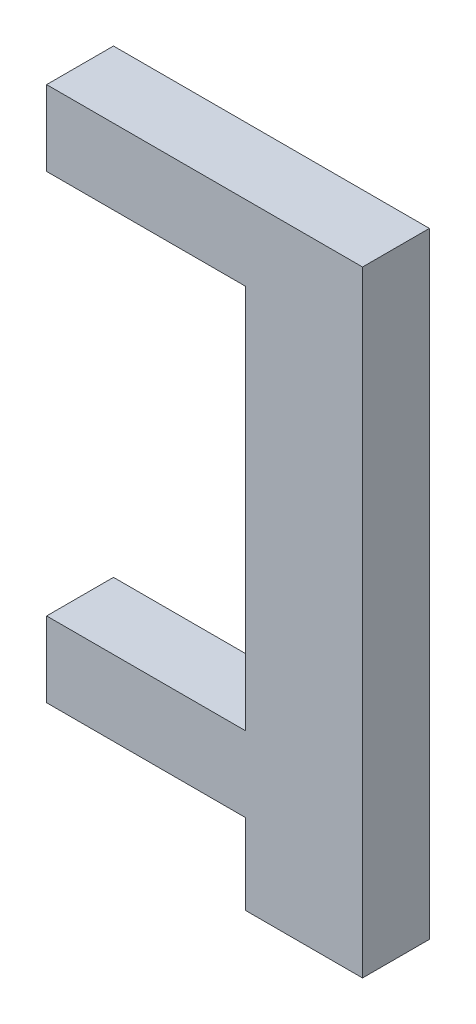
ISO-10303-21;
HEADER;
FILE_DESCRIPTION(('STEP AP214'),'2;1');
FILE_NAME('part.step','',(''),(''),'','','');
FILE_SCHEMA(('AUTOMOTIVE_DESIGN { 1 0 10303 214 1 1 1 1 }'));
ENDSEC;
DATA;
#1=APPLICATION_CONTEXT('core data for automotive mechanical design processes');
#2=APPLICATION_PROTOCOL_DEFINITION('international standard','automotive_design',2000,#1);
#3=PRODUCT_CONTEXT('',#1,'mechanical');
#4=PRODUCT('Part','Part','',(#3));
#5=PRODUCT_RELATED_PRODUCT_CATEGORY('part','',(#4));
#6=PRODUCT_DEFINITION_FORMATION('','',#4);
#7=PRODUCT_DEFINITION_CONTEXT('part definition',#1,'design');
#8=PRODUCT_DEFINITION('design','',#6,#7);
#9=PRODUCT_DEFINITION_SHAPE('','',#8);
#10=(LENGTH_UNIT() NAMED_UNIT(*) SI_UNIT(.MILLI.,.METRE.));
#11=(NAMED_UNIT(*) PLANE_ANGLE_UNIT() SI_UNIT($,.RADIAN.));
#12=(NAMED_UNIT(*) SI_UNIT($,.STERADIAN.) SOLID_ANGLE_UNIT());
#13=UNCERTAINTY_MEASURE_WITH_UNIT(LENGTH_MEASURE(1.E-05),#10,'distance_accuracy_value','');
#14=(GEOMETRIC_REPRESENTATION_CONTEXT(3) GLOBAL_UNCERTAINTY_ASSIGNED_CONTEXT((#13)) GLOBAL_UNIT_ASSIGNED_CONTEXT((#10,
#11,#12)) REPRESENTATION_CONTEXT('',''));
#15=CARTESIAN_POINT('',(0.,0.,0.));
#16=DIRECTION('',(0.,0.,1.));
#17=DIRECTION('',(1.,0.,0.));
#18=AXIS2_PLACEMENT_3D('',#15,#16,#17);
#19=CARTESIAN_POINT('',(-7.,0.,4.));
#20=DIRECTION('',(0.,1.,0.));
#21=DIRECTION('',(0.,0.,1.));
#22=AXIS2_PLACEMENT_3D('',#19,#20,#21);
#23=PLANE('',#22);
#24=DIRECTION('',(1.,0.,0.));
#25=VECTOR('',#24,1.);
#26=CARTESIAN_POINT('',(-7.,0.,0.));
#27=LINE('',#26,#25);
#28=CARTESIAN_POINT('',(-7.,0.,0.));
#29=VERTEX_POINT('',#28);
#30=CARTESIAN_POINT('',(0.,0.,0.));
#31=VERTEX_POINT('',#30);
#32=EDGE_CURVE('E140',#29,#31,#27,.T.);
#33=ORIENTED_EDGE('',*,*,#32,.T.);
#34=DIRECTION('',(0.,0.,-1.));
#35=VECTOR('',#34,1.);
#36=CARTESIAN_POINT('',(0.,0.,4.));
#37=LINE('',#36,#35);
#38=CARTESIAN_POINT('',(0.,0.,4.));
#39=VERTEX_POINT('',#38);
#40=EDGE_CURVE('E11',#39,#31,#37,.T.);
#41=ORIENTED_EDGE('',*,*,#40,.F.);
#42=DIRECTION('',(1.,0.,0.));
#43=VECTOR('',#42,1.);
#44=CARTESIAN_POINT('',(-7.,0.,4.));
#45=LINE('',#44,#43);
#46=CARTESIAN_POINT('',(-7.,0.,4.));
#47=VERTEX_POINT('',#46);
#48=EDGE_CURVE('E158',#47,#39,#45,.T.);
#49=ORIENTED_EDGE('',*,*,#48,.F.);
#50=DIRECTION('',(0.,0.,-1.));
#51=VECTOR('',#50,1.);
#52=CARTESIAN_POINT('',(-7.,0.,4.));
#53=LINE('',#52,#51);
#54=EDGE_CURVE('E136',#47,#29,#53,.T.);
#55=ORIENTED_EDGE('',*,*,#54,.T.);
#56=EDGE_LOOP('',(#33,#41,#49,#55));
#57=FACE_BOUND('',#56,.T.);
#58=ADVANCED_FACE('F32',(#57),#23,.F.);
#59=CARTESIAN_POINT('',(0.,0.,4.));
#60=DIRECTION('',(-1.,0.,0.));
#61=DIRECTION('',(0.,0.,1.));
#62=AXIS2_PLACEMENT_3D('',#59,#60,#61);
#63=PLANE('',#62);
#64=DIRECTION('',(0.,1.,0.));
#65=VECTOR('',#64,1.);
#66=CARTESIAN_POINT('',(0.,0.,0.));
#67=LINE('',#66,#65);
#68=CARTESIAN_POINT('',(0.,36.84,0.));
#69=VERTEX_POINT('',#68);
#70=EDGE_CURVE('E143',#31,#69,#67,.T.);
#71=ORIENTED_EDGE('',*,*,#70,.T.);
#72=DIRECTION('',(0.,0.,-1.));
#73=VECTOR('',#72,1.);
#74=CARTESIAN_POINT('',(0.,36.84,4.));
#75=LINE('',#74,#73);
#76=CARTESIAN_POINT('',(0.,36.84,4.));
#77=VERTEX_POINT('',#76);
#78=EDGE_CURVE('E40',#77,#69,#75,.T.);
#79=ORIENTED_EDGE('',*,*,#78,.F.);
#80=DIRECTION('',(0.,1.,0.));
#81=VECTOR('',#80,1.);
#82=CARTESIAN_POINT('',(0.,0.,4.));
#83=LINE('',#82,#81);
#84=EDGE_CURVE('E97',#39,#77,#83,.T.);
#85=ORIENTED_EDGE('',*,*,#84,.F.);
#86=ORIENTED_EDGE('',*,*,#40,.T.);
#87=EDGE_LOOP('',(#71,#79,#85,#86));
#88=FACE_BOUND('',#87,.T.);
#89=ADVANCED_FACE('F207',(#88),#63,.F.);
#90=CARTESIAN_POINT('',(0.,36.84,4.));
#91=DIRECTION('',(0.,-1.,0.));
#92=DIRECTION('',(1.,0.,0.));
#93=AXIS2_PLACEMENT_3D('',#90,#91,#92);
#94=PLANE('',#93);
#95=DIRECTION('',(-1.,0.,0.));
#96=VECTOR('',#95,1.);
#97=CARTESIAN_POINT('',(0.,36.84,0.));
#98=LINE('',#97,#96);
#99=CARTESIAN_POINT('',(-18.9,36.84,0.));
#100=VERTEX_POINT('',#99);
#101=EDGE_CURVE('E145',#69,#100,#98,.T.);
#102=ORIENTED_EDGE('',*,*,#101,.T.);
#103=DIRECTION('',(0.,0.,-1.));
#104=VECTOR('',#103,1.);
#105=CARTESIAN_POINT('',(-18.9,36.84,4.));
#106=LINE('',#105,#104);
#107=CARTESIAN_POINT('',(-18.9,36.84,4.));
#108=VERTEX_POINT('',#107);
#109=EDGE_CURVE('E171',#108,#100,#106,.T.);
#110=ORIENTED_EDGE('',*,*,#109,.F.);
#111=DIRECTION('',(-1.,0.,0.));
#112=VECTOR('',#111,1.);
#113=CARTESIAN_POINT('',(0.,36.84,4.));
#114=LINE('',#113,#112);
#115=EDGE_CURVE('E179',#77,#108,#114,.T.);
#116=ORIENTED_EDGE('',*,*,#115,.F.);
#117=ORIENTED_EDGE('',*,*,#78,.T.);
#118=EDGE_LOOP('',(#102,#110,#116,#117));
#119=FACE_BOUND('',#118,.T.);
#120=ADVANCED_FACE('F177',(#119),#94,.F.);
#121=CARTESIAN_POINT('',(-18.9,36.84,4.));
#122=DIRECTION('',(1.,0.,0.));
#123=DIRECTION('',(0.,0.,-1.));
#124=AXIS2_PLACEMENT_3D('',#121,#122,#123);
#125=PLANE('',#124);
#126=DIRECTION('',(0.,-1.,0.));
#127=VECTOR('',#126,1.);
#128=CARTESIAN_POINT('',(-18.9,36.84,0.));
#129=LINE('',#128,#127);
#130=CARTESIAN_POINT('',(-18.9,32.34,0.));
#131=VERTEX_POINT('',#130);
#132=EDGE_CURVE('E147',#100,#131,#129,.T.);
#133=ORIENTED_EDGE('',*,*,#132,.T.);
#134=DIRECTION('',(0.,0.,-1.));
#135=VECTOR('',#134,1.);
#136=CARTESIAN_POINT('',(-18.9,32.34,4.));
#137=LINE('',#136,#135);
#138=CARTESIAN_POINT('',(-18.9,32.34,4.));
#139=VERTEX_POINT('',#138);
#140=EDGE_CURVE('E168',#139,#131,#137,.T.);
#141=ORIENTED_EDGE('',*,*,#140,.F.);
#142=DIRECTION('',(0.,-1.,0.));
#143=VECTOR('',#142,1.);
#144=CARTESIAN_POINT('',(-18.9,36.84,4.));
#145=LINE('',#144,#143);
#146=EDGE_CURVE('E197',#108,#139,#145,.T.);
#147=ORIENTED_EDGE('',*,*,#146,.F.);
#148=ORIENTED_EDGE('',*,*,#109,.T.);
#149=EDGE_LOOP('',(#133,#141,#147,#148));
#150=FACE_BOUND('',#149,.T.);
#151=ADVANCED_FACE('F188',(#150),#125,.F.);
#152=CARTESIAN_POINT('',(-18.9,32.34,4.));
#153=DIRECTION('',(0.,1.,0.));
#154=DIRECTION('',(0.,0.,1.));
#155=AXIS2_PLACEMENT_3D('',#152,#153,#154);
#156=PLANE('',#155);
#157=DIRECTION('',(1.,0.,0.));
#158=VECTOR('',#157,1.);
#159=CARTESIAN_POINT('',(-18.9,32.34,0.));
#160=LINE('',#159,#158);
#161=CARTESIAN_POINT('',(-7.00000000000001,32.34,0.));
#162=VERTEX_POINT('',#161);
#163=EDGE_CURVE('E149',#131,#162,#160,.T.);
#164=ORIENTED_EDGE('',*,*,#163,.T.);
#165=DIRECTION('',(0.,0.,-1.));
#166=VECTOR('',#165,1.);
#167=CARTESIAN_POINT('',(-7.00000000000001,32.34,4.));
#168=LINE('',#167,#166);
#169=CARTESIAN_POINT('',(-7.00000000000001,32.34,4.));
#170=VERTEX_POINT('',#169);
#171=EDGE_CURVE('E165',#170,#162,#168,.T.);
#172=ORIENTED_EDGE('',*,*,#171,.F.);
#173=DIRECTION('',(1.,0.,0.));
#174=VECTOR('',#173,1.);
#175=CARTESIAN_POINT('',(-18.9,32.34,4.));
#176=LINE('',#175,#174);
#177=EDGE_CURVE('E194',#139,#170,#176,.T.);
#178=ORIENTED_EDGE('',*,*,#177,.F.);
#179=ORIENTED_EDGE('',*,*,#140,.T.);
#180=EDGE_LOOP('',(#164,#172,#178,#179));
#181=FACE_BOUND('',#180,.T.);
#182=ADVANCED_FACE('F192',(#181),#156,.F.);
#183=CARTESIAN_POINT('',(-7.00000000000001,32.34,4.));
#184=DIRECTION('',(1.,0.,0.));
#185=DIRECTION('',(0.,1.,0.));
#186=AXIS2_PLACEMENT_3D('',#183,#184,#185);
#187=PLANE('',#186);
#188=DIRECTION('',(0.,-1.,0.));
#189=VECTOR('',#188,1.);
#190=CARTESIAN_POINT('',(-7.00000000000001,32.34,0.));
#191=LINE('',#190,#189);
#192=CARTESIAN_POINT('',(-7.,9.31000000000001,0.));
#193=VERTEX_POINT('',#192);
#194=EDGE_CURVE('E151',#162,#193,#191,.T.);
#195=ORIENTED_EDGE('',*,*,#194,.T.);
#196=DIRECTION('',(0.,0.,-1.));
#197=VECTOR('',#196,1.);
#198=CARTESIAN_POINT('',(-7.,9.31000000000001,4.));
#199=LINE('',#198,#197);
#200=CARTESIAN_POINT('',(-7.,9.31000000000001,4.));
#201=VERTEX_POINT('',#200);
#202=EDGE_CURVE('E162',#201,#193,#199,.T.);
#203=ORIENTED_EDGE('',*,*,#202,.F.);
#204=DIRECTION('',(0.,-1.,0.));
#205=VECTOR('',#204,1.);
#206=CARTESIAN_POINT('',(-7.00000000000001,32.34,4.));
#207=LINE('',#206,#205);
#208=EDGE_CURVE('E196',#170,#201,#207,.T.);
#209=ORIENTED_EDGE('',*,*,#208,.F.);
#210=ORIENTED_EDGE('',*,*,#171,.T.);
#211=EDGE_LOOP('',(#195,#203,#209,#210));
#212=FACE_BOUND('',#211,.T.);
#213=ADVANCED_FACE('F219',(#212),#187,.F.);
#214=CARTESIAN_POINT('',(-7.,9.31000000000001,4.));
#215=DIRECTION('',(0.,-1.,0.));
#216=DIRECTION('',(1.,0.,0.));
#217=AXIS2_PLACEMENT_3D('',#214,#215,#216);
#218=PLANE('',#217);
#219=DIRECTION('',(-1.,0.,0.));
#220=VECTOR('',#219,1.);
#221=CARTESIAN_POINT('',(-7.,9.31000000000001,0.));
#222=LINE('',#221,#220);
#223=CARTESIAN_POINT('',(-18.9,9.31,0.));
#224=VERTEX_POINT('',#223);
#225=EDGE_CURVE('E153',#193,#224,#222,.T.);
#226=ORIENTED_EDGE('',*,*,#225,.T.);
#227=DIRECTION('',(0.,0.,-1.));
#228=VECTOR('',#227,1.);
#229=CARTESIAN_POINT('',(-18.9,9.31,4.));
#230=LINE('',#229,#228);
#231=CARTESIAN_POINT('',(-18.9,9.31,4.));
#232=VERTEX_POINT('',#231);
#233=EDGE_CURVE('E131',#232,#224,#230,.T.);
#234=ORIENTED_EDGE('',*,*,#233,.F.);
#235=DIRECTION('',(-1.,0.,0.));
#236=VECTOR('',#235,1.);
#237=CARTESIAN_POINT('',(-7.,9.31000000000001,4.));
#238=LINE('',#237,#236);
#239=EDGE_CURVE('E122',#201,#232,#238,.T.);
#240=ORIENTED_EDGE('',*,*,#239,.F.);
#241=ORIENTED_EDGE('',*,*,#202,.T.);
#242=EDGE_LOOP('',(#226,#234,#240,#241));
#243=FACE_BOUND('',#242,.T.);
#244=ADVANCED_FACE('F222',(#243),#218,.F.);
#245=CARTESIAN_POINT('',(-18.9,9.31,4.));
#246=DIRECTION('',(1.,0.,0.));
#247=DIRECTION('',(0.,0.,-1.));
#248=AXIS2_PLACEMENT_3D('',#245,#246,#247);
#249=PLANE('',#248);
#250=DIRECTION('',(0.,-1.,0.));
#251=VECTOR('',#250,1.);
#252=CARTESIAN_POINT('',(-18.9,9.31,0.));
#253=LINE('',#252,#251);
#254=CARTESIAN_POINT('',(-18.9,4.81,0.));
#255=VERTEX_POINT('',#254);
#256=EDGE_CURVE('E130',#224,#255,#253,.T.);
#257=ORIENTED_EDGE('',*,*,#256,.T.);
#258=DIRECTION('',(0.,0.,-1.));
#259=VECTOR('',#258,1.);
#260=CARTESIAN_POINT('',(-18.9,4.81,4.));
#261=LINE('',#260,#259);
#262=CARTESIAN_POINT('',(-18.9,4.81,4.));
#263=VERTEX_POINT('',#262);
#264=EDGE_CURVE('E127',#263,#255,#261,.T.);
#265=ORIENTED_EDGE('',*,*,#264,.F.);
#266=DIRECTION('',(0.,-1.,0.));
#267=VECTOR('',#266,1.);
#268=CARTESIAN_POINT('',(-18.9,9.31,4.));
#269=LINE('',#268,#267);
#270=EDGE_CURVE('E116',#232,#263,#269,.T.);
#271=ORIENTED_EDGE('',*,*,#270,.F.);
#272=ORIENTED_EDGE('',*,*,#233,.T.);
#273=EDGE_LOOP('',(#257,#265,#271,#272));
#274=FACE_BOUND('',#273,.T.);
#275=ADVANCED_FACE('F128',(#274),#249,.F.);
#276=CARTESIAN_POINT('',(-18.9,4.81,4.));
#277=DIRECTION('',(0.,1.,0.));
#278=DIRECTION('',(-1.,0.,0.));
#279=AXIS2_PLACEMENT_3D('',#276,#277,#278);
#280=PLANE('',#279);
#281=DIRECTION('',(1.,0.,0.));
#282=VECTOR('',#281,1.);
#283=CARTESIAN_POINT('',(-18.9,4.81,0.));
#284=LINE('',#283,#282);
#285=CARTESIAN_POINT('',(-7.,4.81,0.));
#286=VERTEX_POINT('',#285);
#287=EDGE_CURVE('E83',#255,#286,#284,.T.);
#288=ORIENTED_EDGE('',*,*,#287,.T.);
#289=DIRECTION('',(0.,0.,-1.));
#290=VECTOR('',#289,1.);
#291=CARTESIAN_POINT('',(-7.,4.81,4.));
#292=LINE('',#291,#290);
#293=CARTESIAN_POINT('',(-7.,4.81,4.));
#294=VERTEX_POINT('',#293);
#295=EDGE_CURVE('E132',#294,#286,#292,.T.);
#296=ORIENTED_EDGE('',*,*,#295,.F.);
#297=DIRECTION('',(1.,0.,0.));
#298=VECTOR('',#297,1.);
#299=CARTESIAN_POINT('',(-18.9,4.81,4.));
#300=LINE('',#299,#298);
#301=EDGE_CURVE('E120',#263,#294,#300,.T.);
#302=ORIENTED_EDGE('',*,*,#301,.F.);
#303=ORIENTED_EDGE('',*,*,#264,.T.);
#304=EDGE_LOOP('',(#288,#296,#302,#303));
#305=FACE_BOUND('',#304,.T.);
#306=ADVANCED_FACE('F134',(#305),#280,.F.);
#307=CARTESIAN_POINT('',(-7.,4.81,4.));
#308=DIRECTION('',(1.,0.,0.));
#309=DIRECTION('',(0.,1.,0.));
#310=AXIS2_PLACEMENT_3D('',#307,#308,#309);
#311=PLANE('',#310);
#312=DIRECTION('',(0.,-1.,0.));
#313=VECTOR('',#312,1.);
#314=CARTESIAN_POINT('',(-7.,4.81,0.));
#315=LINE('',#314,#313);
#316=EDGE_CURVE('E89',#286,#29,#315,.T.);
#317=ORIENTED_EDGE('',*,*,#316,.T.);
#318=ORIENTED_EDGE('',*,*,#54,.F.);
#319=DIRECTION('',(0.,-1.,0.));
#320=VECTOR('',#319,1.);
#321=CARTESIAN_POINT('',(-7.,4.81,4.));
#322=LINE('',#321,#320);
#323=EDGE_CURVE('E48',#294,#47,#322,.T.);
#324=ORIENTED_EDGE('',*,*,#323,.F.);
#325=ORIENTED_EDGE('',*,*,#295,.T.);
#326=EDGE_LOOP('',(#317,#318,#324,#325));
#327=FACE_BOUND('',#326,.T.);
#328=ADVANCED_FACE('F231',(#327),#311,.F.);
#329=CARTESIAN_POINT('',(0.,0.,4.));
#330=DIRECTION('',(0.,0.,1.));
#331=DIRECTION('',(1.,0.,0.));
#332=AXIS2_PLACEMENT_3D('',#329,#330,#331);
#333=PLANE('',#332);
#334=ORIENTED_EDGE('',*,*,#48,.T.);
#335=ORIENTED_EDGE('',*,*,#84,.T.);
#336=ORIENTED_EDGE('',*,*,#115,.T.);
#337=ORIENTED_EDGE('',*,*,#146,.T.);
#338=ORIENTED_EDGE('',*,*,#177,.T.);
#339=ORIENTED_EDGE('',*,*,#208,.T.);
#340=ORIENTED_EDGE('',*,*,#239,.T.);
#341=ORIENTED_EDGE('',*,*,#270,.T.);
#342=ORIENTED_EDGE('',*,*,#301,.T.);
#343=ORIENTED_EDGE('',*,*,#323,.T.);
#344=EDGE_LOOP('',(#334,#335,#336,#337,#338,#339,#340,#341,#342,#343));
#345=FACE_BOUND('',#344,.T.);
#346=ADVANCED_FACE('F118',(#345),#333,.T.);
#347=CARTESIAN_POINT('',(0.,0.,0.));
#348=DIRECTION('',(0.,0.,1.));
#349=DIRECTION('',(1.,0.,0.));
#350=AXIS2_PLACEMENT_3D('',#347,#348,#349);
#351=PLANE('',#350);
#352=ORIENTED_EDGE('',*,*,#32,.F.);
#353=ORIENTED_EDGE('',*,*,#316,.F.);
#354=ORIENTED_EDGE('',*,*,#287,.F.);
#355=ORIENTED_EDGE('',*,*,#256,.F.);
#356=ORIENTED_EDGE('',*,*,#225,.F.);
#357=ORIENTED_EDGE('',*,*,#194,.F.);
#358=ORIENTED_EDGE('',*,*,#163,.F.);
#359=ORIENTED_EDGE('',*,*,#132,.F.);
#360=ORIENTED_EDGE('',*,*,#101,.F.);
#361=ORIENTED_EDGE('',*,*,#70,.F.);
#362=EDGE_LOOP('',(#352,#353,#354,#355,#356,#357,#358,#359,#360,#361));
#363=FACE_BOUND('',#362,.T.);
#364=ADVANCED_FACE('F183',(#363),#351,.F.);
#365=CLOSED_SHELL('',(#58,#89,#120,#151,#182,#213,#244,#275,#306,#328,#346,#364));
#366=MANIFOLD_SOLID_BREP('B2',#365);
#367=ADVANCED_BREP_SHAPE_REPRESENTATION('',(#18,#366),#14);
#368=SHAPE_DEFINITION_REPRESENTATION(#9,#367);
ENDSEC;
END-ISO-10303-21;
